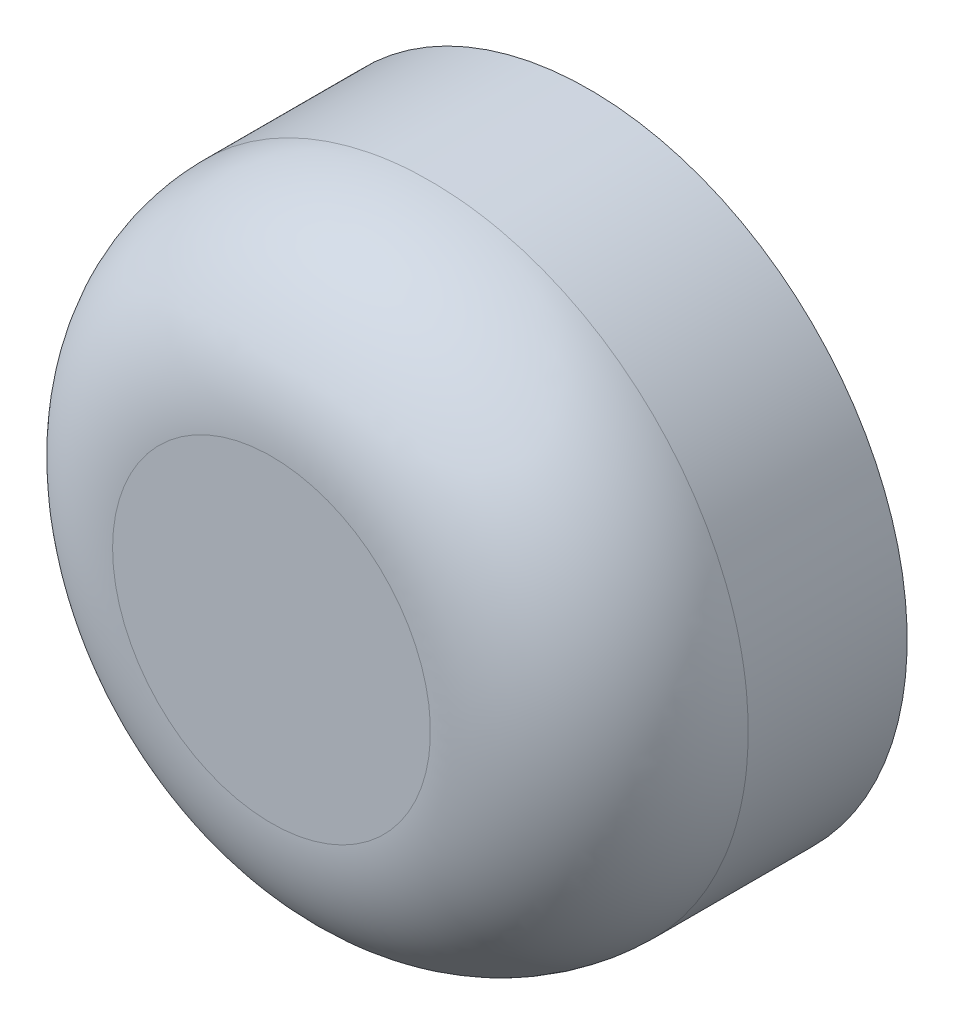
ISO-10303-21;
HEADER;
FILE_DESCRIPTION(('STEP AP214'),'2;1');
FILE_NAME('part.step','',(''),(''),'','','');
FILE_SCHEMA(('AUTOMOTIVE_DESIGN { 1 0 10303 214 1 1 1 1 }'));
ENDSEC;
DATA;
#1=APPLICATION_CONTEXT('core data for automotive mechanical design processes');
#2=APPLICATION_PROTOCOL_DEFINITION('international standard','automotive_design',2000,#1);
#3=PRODUCT_CONTEXT('',#1,'mechanical');
#4=PRODUCT('Part','Part','',(#3));
#5=PRODUCT_RELATED_PRODUCT_CATEGORY('part','',(#4));
#6=PRODUCT_DEFINITION_FORMATION('','',#4);
#7=PRODUCT_DEFINITION_CONTEXT('part definition',#1,'design');
#8=PRODUCT_DEFINITION('design','',#6,#7);
#9=PRODUCT_DEFINITION_SHAPE('','',#8);
#10=(LENGTH_UNIT() NAMED_UNIT(*) SI_UNIT(.MILLI.,.METRE.));
#11=(NAMED_UNIT(*) PLANE_ANGLE_UNIT() SI_UNIT($,.RADIAN.));
#12=(NAMED_UNIT(*) SI_UNIT($,.STERADIAN.) SOLID_ANGLE_UNIT());
#13=UNCERTAINTY_MEASURE_WITH_UNIT(LENGTH_MEASURE(1.E-05),#10,'distance_accuracy_value','');
#14=(GEOMETRIC_REPRESENTATION_CONTEXT(3) GLOBAL_UNCERTAINTY_ASSIGNED_CONTEXT((#13)) GLOBAL_UNIT_ASSIGNED_CONTEXT((#10,
#11,#12)) REPRESENTATION_CONTEXT('',''));
#15=CARTESIAN_POINT('',(0.,0.,0.));
#16=DIRECTION('',(0.,0.,1.));
#17=DIRECTION('',(1.,0.,0.));
#18=AXIS2_PLACEMENT_3D('',#15,#16,#17);
#19=CARTESIAN_POINT('',(0.,0.,0.));
#20=DIRECTION('',(0.,0.,1.));
#21=DIRECTION('',(1.,0.,0.));
#22=AXIS2_PLACEMENT_3D('',#19,#20,#21);
#23=PLANE('',#22);
#24=CARTESIAN_POINT('',(0.,0.,0.));
#25=DIRECTION('',(0.,0.,1.));
#26=DIRECTION('',(1.,0.,0.));
#27=AXIS2_PLACEMENT_3D('',#24,#25,#26);
#28=CIRCLE('',#27,4.);
#29=CARTESIAN_POINT('',(-4.,0.,0.));
#30=VERTEX_POINT('',#29);
#31=EDGE_CURVE('E11',#30,#30,#28,.T.);
#32=ORIENTED_EDGE('',*,*,#31,.F.);
#33=EDGE_LOOP('',(#32));
#34=FACE_BOUND('',#33,.T.);
#35=ADVANCED_FACE('F16',(#34),#23,.F.);
#36=CARTESIAN_POINT('',(0.,0.,4.));
#37=DIRECTION('',(0.,0.,1.));
#38=DIRECTION('',(1.,0.,0.));
#39=AXIS2_PLACEMENT_3D('',#36,#37,#38);
#40=PLANE('',#39);
#41=CARTESIAN_POINT('',(0.,0.,4.));
#42=DIRECTION('',(0.,0.,-1.));
#43=DIRECTION('',(1.,0.,0.));
#44=AXIS2_PLACEMENT_3D('',#41,#42,#43);
#45=CIRCLE('',#44,2.);
#46=CARTESIAN_POINT('',(-2.,0.,4.));
#47=VERTEX_POINT('',#46);
#48=EDGE_CURVE('E48',#47,#47,#45,.T.);
#49=ORIENTED_EDGE('',*,*,#48,.F.);
#50=EDGE_LOOP('',(#49));
#51=FACE_BOUND('',#50,.T.);
#52=ADVANCED_FACE('F18',(#51),#40,.T.);
#53=CARTESIAN_POINT('',(0.,0.,0.));
#54=DIRECTION('',(0.,0.,1.));
#55=DIRECTION('',(1.,0.,0.));
#56=AXIS2_PLACEMENT_3D('',#53,#54,#55);
#57=CYLINDRICAL_SURFACE('',#56,4.);
#58=CARTESIAN_POINT('',(0.,0.,2.));
#59=DIRECTION('',(0.,0.,1.));
#60=DIRECTION('',(1.,0.,0.));
#61=AXIS2_PLACEMENT_3D('',#58,#59,#60);
#62=CIRCLE('',#61,4.);
#63=CARTESIAN_POINT('',(-4.,0.,2.));
#64=VERTEX_POINT('',#63);
#65=EDGE_CURVE('E50',#64,#64,#62,.T.);
#66=ORIENTED_EDGE('',*,*,#65,.F.);
#67=DIRECTION('',(0.,0.,-1.));
#68=VECTOR('',#67,1.);
#69=CARTESIAN_POINT('',(-4.,0.,0.));
#70=LINE('',#69,#68);
#71=EDGE_CURVE('E26',#64,#30,#70,.T.);
#72=ORIENTED_EDGE('',*,*,#71,.T.);
#73=ORIENTED_EDGE('',*,*,#31,.T.);
#74=ORIENTED_EDGE('',*,*,#71,.F.);
#75=EDGE_LOOP('',(#66,#72,#73,#74));
#76=FACE_BOUND('',#75,.T.);
#77=ADVANCED_FACE('F63',(#76),#57,.T.);
#78=CARTESIAN_POINT('',(-4.,0.,2.));
#79=CARTESIAN_POINT('',(-4.,-4.,2.));
#80=CARTESIAN_POINT('',(0.,-4.,2.));
#81=CARTESIAN_POINT('',(4.,-4.,2.));
#82=CARTESIAN_POINT('',(4.,0.,2.));
#83=CARTESIAN_POINT('',(4.,4.,2.));
#84=CARTESIAN_POINT('',(0.,4.,2.));
#85=CARTESIAN_POINT('',(-4.,4.,2.));
#86=CARTESIAN_POINT('',(-4.,0.,2.));
#87=CARTESIAN_POINT('',(-4.,0.,4.));
#88=CARTESIAN_POINT('',(-4.,-4.,4.));
#89=CARTESIAN_POINT('',(0.,-4.,4.));
#90=CARTESIAN_POINT('',(4.,-4.,4.));
#91=CARTESIAN_POINT('',(4.,0.,4.));
#92=CARTESIAN_POINT('',(4.,4.,4.));
#93=CARTESIAN_POINT('',(0.,4.,4.));
#94=CARTESIAN_POINT('',(-4.,4.,4.));
#95=CARTESIAN_POINT('',(-4.,0.,4.));
#96=CARTESIAN_POINT('',(-2.,0.,4.));
#97=CARTESIAN_POINT('',(-2.,-2.,4.));
#98=CARTESIAN_POINT('',(0.,-2.,4.));
#99=CARTESIAN_POINT('',(2.,-2.,4.));
#100=CARTESIAN_POINT('',(2.,0.,4.));
#101=CARTESIAN_POINT('',(2.,2.,4.));
#102=CARTESIAN_POINT('',(0.,2.,4.));
#103=CARTESIAN_POINT('',(-2.,2.,4.));
#104=CARTESIAN_POINT('',(-2.,0.,4.));
#105=(BOUNDED_SURFACE() B_SPLINE_SURFACE(2,2,((#78,#79,#80,#81,#82,#83,#84,#85,#86),(#87,#88,
#89,#90,#91,#92,#93,#94,#95),(#96,#97,#98,#99,#100,#101,#102,#103,#104)),.UNSPECIFIED.,.F.,.T.,
.F.) B_SPLINE_SURFACE_WITH_KNOTS((3,3),(3,2,2,2,3),(0.,1.5707963267949),(-3.14159265358979,
-1.5707963267949,0.,1.5707963267949,3.14159265358979),
.UNSPECIFIED.) GEOMETRIC_REPRESENTATION_ITEM() RATIONAL_B_SPLINE_SURFACE(((1.,0.707106781186548,
1.,0.707106781186548,1.,0.707106781186548,1.,0.707106781186548,1.),(0.707106781186547,0.5,
0.707106781186547,0.5,0.707106781186547,0.5,0.707106781186547,0.5,0.707106781186547),(1.,
0.707106781186548,1.,0.707106781186548,1.,0.707106781186548,1.,0.707106781186548,1.))) REPRESENTATION_ITEM('') SURFACE());
#106=CARTESIAN_POINT('',(-2.,0.,2.));
#107=DIRECTION('',(0.,-1.,0.));
#108=DIRECTION('',(-1.,0.,0.));
#109=AXIS2_PLACEMENT_3D('',#106,#107,#108);
#110=CIRCLE('',#109,2.);
#111=EDGE_CURVE('E45',#47,#64,#110,.T.);
#112=ORIENTED_EDGE('',*,*,#48,.T.);
#113=ORIENTED_EDGE('',*,*,#111,.T.);
#114=ORIENTED_EDGE('',*,*,#65,.T.);
#115=ORIENTED_EDGE('',*,*,#111,.F.);
#116=EDGE_LOOP('',(#112,#113,#114,#115));
#117=FACE_BOUND('',#116,.T.);
#118=ADVANCED_FACE('F46',(#117),#105,.F.);
#119=CLOSED_SHELL('',(#35,#52,#77,#118));
#120=MANIFOLD_SOLID_BREP('B1',#119);
#121=ADVANCED_BREP_SHAPE_REPRESENTATION('',(#18,#120),#14);
#122=SHAPE_DEFINITION_REPRESENTATION(#9,#121);
ENDSEC;
END-ISO-10303-21;
